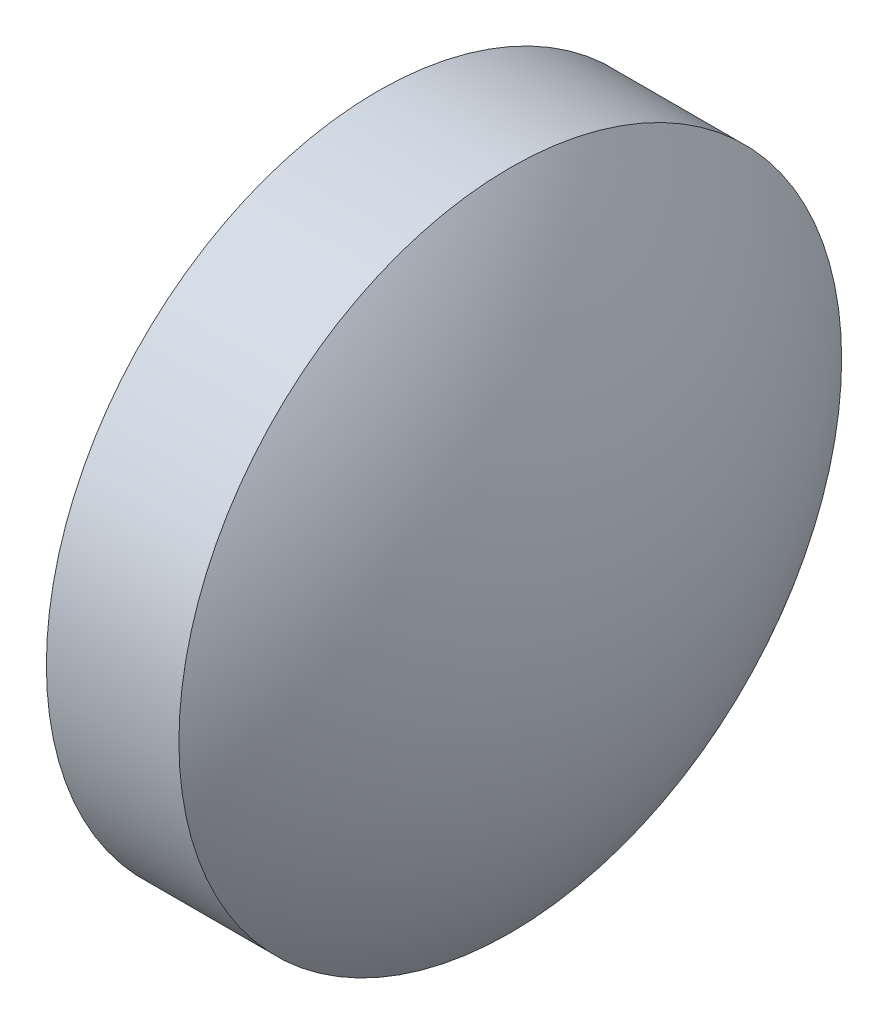
ISO-10303-21;
HEADER;
FILE_DESCRIPTION(('STEP AP214'),'2;1');
FILE_NAME('part.step','',(''),(''),'','','');
FILE_SCHEMA(('AUTOMOTIVE_DESIGN { 1 0 10303 214 1 1 1 1 }'));
ENDSEC;
DATA;
#1=APPLICATION_CONTEXT('core data for automotive mechanical design processes');
#2=APPLICATION_PROTOCOL_DEFINITION('international standard','automotive_design',2000,#1);
#3=PRODUCT_CONTEXT('',#1,'mechanical');
#4=PRODUCT('Part','Part','',(#3));
#5=PRODUCT_RELATED_PRODUCT_CATEGORY('part','',(#4));
#6=PRODUCT_DEFINITION_FORMATION('','',#4);
#7=PRODUCT_DEFINITION_CONTEXT('part definition',#1,'design');
#8=PRODUCT_DEFINITION('design','',#6,#7);
#9=PRODUCT_DEFINITION_SHAPE('','',#8);
#10=(LENGTH_UNIT() NAMED_UNIT(*) SI_UNIT(.MILLI.,.METRE.));
#11=(NAMED_UNIT(*) PLANE_ANGLE_UNIT() SI_UNIT($,.RADIAN.));
#12=(NAMED_UNIT(*) SI_UNIT($,.STERADIAN.) SOLID_ANGLE_UNIT());
#13=UNCERTAINTY_MEASURE_WITH_UNIT(LENGTH_MEASURE(1.E-05),#10,'distance_accuracy_value','');
#14=(GEOMETRIC_REPRESENTATION_CONTEXT(3) GLOBAL_UNCERTAINTY_ASSIGNED_CONTEXT((#13)) GLOBAL_UNIT_ASSIGNED_CONTEXT((#10,
#11,#12)) REPRESENTATION_CONTEXT('',''));
#15=CARTESIAN_POINT('',(0.,0.,0.));
#16=DIRECTION('',(0.,0.,1.));
#17=DIRECTION('',(1.,0.,0.));
#18=AXIS2_PLACEMENT_3D('',#15,#16,#17);
#19=CARTESIAN_POINT('',(19.8967079268143,9.57010098881588,0.));
#20=DIRECTION('',(-1.,0.,0.));
#21=DIRECTION('',(0.,1.,0.));
#22=AXIS2_PLACEMENT_3D('',#19,#20,#21);
#23=SPHERICAL_SURFACE('',#22,4.20198585806547);
#24=CARTESIAN_POINT('',(16.5193294832013,9.57010098881589,0.));
#25=DIRECTION('',(-1.,0.,0.));
#26=DIRECTION('',(0.,-1.,0.));
#27=AXIS2_PLACEMENT_3D('',#24,#25,#26);
#28=CIRCLE('',#27,2.5);
#29=CARTESIAN_POINT('',(16.5193294832013,7.07010098881589,0.));
#30=VERTEX_POINT('',#29);
#31=EDGE_CURVE('E46',#30,#30,#28,.T.);
#32=ORIENTED_EDGE('',*,*,#31,.T.);
#33=EDGE_LOOP('',(#32));
#34=FACE_BOUND('',#33,.T.);
#35=ADVANCED_FACE('F39',(#34),#23,.T.);
#36=CARTESIAN_POINT('',(14.1419510395882,9.57010098881589,0.));
#37=DIRECTION('',(-1.,0.,0.));
#38=DIRECTION('',(0.,1.,0.));
#39=AXIS2_PLACEMENT_3D('',#36,#37,#38);
#40=SPHERICAL_SURFACE('',#39,4.20198585806547);
#41=CARTESIAN_POINT('',(17.5193294832013,9.57010098881589,0.));
#42=DIRECTION('',(-1.,0.,0.));
#43=DIRECTION('',(0.,-1.,0.));
#44=AXIS2_PLACEMENT_3D('',#41,#42,#43);
#45=CIRCLE('',#44,2.5);
#46=CARTESIAN_POINT('',(17.5193294832013,7.07010098881589,0.));
#47=VERTEX_POINT('',#46);
#48=EDGE_CURVE('E10',#47,#47,#45,.T.);
#49=ORIENTED_EDGE('',*,*,#48,.F.);
#50=EDGE_LOOP('',(#49));
#51=FACE_BOUND('',#50,.T.);
#52=ADVANCED_FACE('F56',(#51),#40,.T.);
#53=CARTESIAN_POINT('',(15.2361801007149,9.57010098881589,0.));
#54=DIRECTION('',(-1.,0.,0.));
#55=DIRECTION('',(0.,-1.,0.));
#56=AXIS2_PLACEMENT_3D('',#53,#54,#55);
#57=CYLINDRICAL_SURFACE('',#56,2.5);
#58=ORIENTED_EDGE('',*,*,#48,.T.);
#59=EDGE_LOOP('',(#58));
#60=FACE_BOUND('',#59,.T.);
#61=ORIENTED_EDGE('',*,*,#31,.F.);
#62=EDGE_LOOP('',(#61));
#63=FACE_BOUND('',#62,.T.);
#64=ADVANCED_FACE('F54',(#60,#63),#57,.T.);
#65=CLOSED_SHELL('',(#35,#52,#64));
#66=MANIFOLD_SOLID_BREP('B2',#65);
#67=ADVANCED_BREP_SHAPE_REPRESENTATION('',(#18,#66),#14);
#68=SHAPE_DEFINITION_REPRESENTATION(#9,#67);
ENDSEC;
END-ISO-10303-21;
